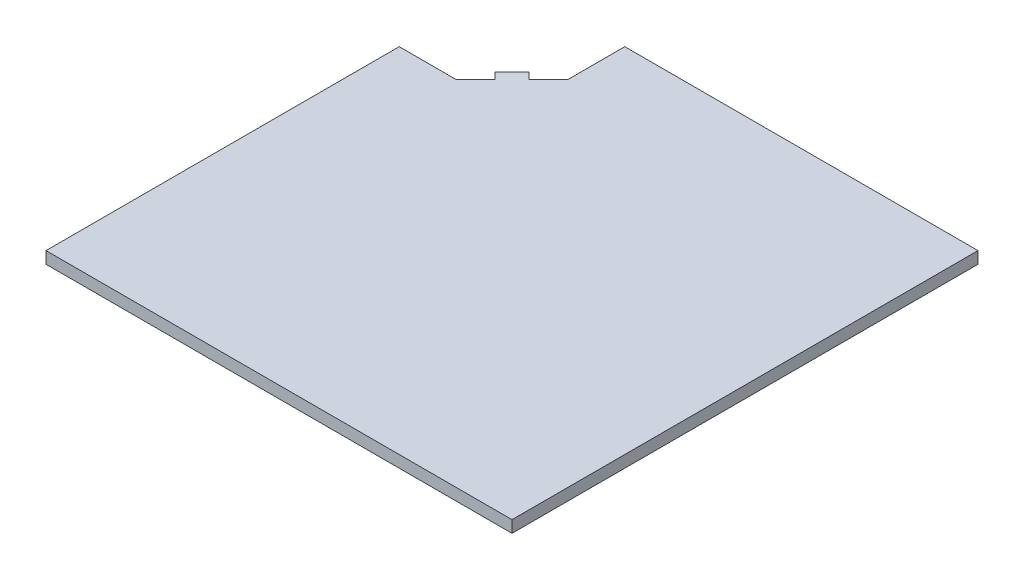
ISO-10303-21;
HEADER;
FILE_DESCRIPTION(('STEP AP214'),'2;1');
FILE_NAME('part.step','',(''),(''),'','','');
FILE_SCHEMA(('AUTOMOTIVE_DESIGN { 1 0 10303 214 1 1 1 1 }'));
ENDSEC;
DATA;
#1=APPLICATION_CONTEXT('core data for automotive mechanical design processes');
#2=APPLICATION_PROTOCOL_DEFINITION('international standard','automotive_design',2000,#1);
#3=PRODUCT_CONTEXT('',#1,'mechanical');
#4=PRODUCT('Part','Part','',(#3));
#5=PRODUCT_RELATED_PRODUCT_CATEGORY('part','',(#4));
#6=PRODUCT_DEFINITION_FORMATION('','',#4);
#7=PRODUCT_DEFINITION_CONTEXT('part definition',#1,'design');
#8=PRODUCT_DEFINITION('design','',#6,#7);
#9=PRODUCT_DEFINITION_SHAPE('','',#8);
#10=(LENGTH_UNIT() NAMED_UNIT(*) SI_UNIT(.MILLI.,.METRE.));
#11=(NAMED_UNIT(*) PLANE_ANGLE_UNIT() SI_UNIT($,.RADIAN.));
#12=(NAMED_UNIT(*) SI_UNIT($,.STERADIAN.) SOLID_ANGLE_UNIT());
#13=UNCERTAINTY_MEASURE_WITH_UNIT(LENGTH_MEASURE(1.E-05),#10,'distance_accuracy_value','');
#14=(GEOMETRIC_REPRESENTATION_CONTEXT(3) GLOBAL_UNCERTAINTY_ASSIGNED_CONTEXT((#13)) GLOBAL_UNIT_ASSIGNED_CONTEXT((#10,
#11,#12)) REPRESENTATION_CONTEXT('',''));
#15=CARTESIAN_POINT('',(0.,0.,0.));
#16=DIRECTION('',(0.,0.,1.));
#17=DIRECTION('',(1.,0.,0.));
#18=AXIS2_PLACEMENT_3D('',#15,#16,#17);
#19=CARTESIAN_POINT('',(3.925,0.2,3.925));
#20=DIRECTION('',(-1.,0.,0.));
#21=DIRECTION('',(0.,0.,1.));
#22=AXIS2_PLACEMENT_3D('',#19,#20,#21);
#23=PLANE('',#22);
#24=DIRECTION('',(0.,0.,-1.));
#25=VECTOR('',#24,1.);
#26=CARTESIAN_POINT('',(3.925,0.,3.925));
#27=LINE('',#26,#25);
#28=CARTESIAN_POINT('',(3.925,0.,3.925));
#29=VERTEX_POINT('',#28);
#30=CARTESIAN_POINT('',(3.925,0.,-3.925));
#31=VERTEX_POINT('',#30);
#32=EDGE_CURVE('E150',#29,#31,#27,.T.);
#33=ORIENTED_EDGE('',*,*,#32,.T.);
#34=DIRECTION('',(0.,-1.,0.));
#35=VECTOR('',#34,1.);
#36=CARTESIAN_POINT('',(3.925,0.2,-3.925));
#37=LINE('',#36,#35);
#38=CARTESIAN_POINT('',(3.925,0.2,-3.925));
#39=VERTEX_POINT('',#38);
#40=EDGE_CURVE('E11',#39,#31,#37,.T.);
#41=ORIENTED_EDGE('',*,*,#40,.F.);
#42=DIRECTION('',(0.,0.,-1.));
#43=VECTOR('',#42,1.);
#44=CARTESIAN_POINT('',(3.925,0.2,3.925));
#45=LINE('',#44,#43);
#46=CARTESIAN_POINT('',(3.925,0.2,3.925));
#47=VERTEX_POINT('',#46);
#48=EDGE_CURVE('E147',#47,#39,#45,.T.);
#49=ORIENTED_EDGE('',*,*,#48,.F.);
#50=DIRECTION('',(0.,-1.,0.));
#51=VECTOR('',#50,1.);
#52=CARTESIAN_POINT('',(3.925,0.2,3.925));
#53=LINE('',#52,#51);
#54=EDGE_CURVE('E154',#47,#29,#53,.T.);
#55=ORIENTED_EDGE('',*,*,#54,.T.);
#56=EDGE_LOOP('',(#33,#41,#49,#55));
#57=FACE_BOUND('',#56,.T.);
#58=ADVANCED_FACE('F32',(#57),#23,.F.);
#59=CARTESIAN_POINT('',(-3.925,0.2,-3.925));
#60=DIRECTION('',(0.,0.,1.));
#61=DIRECTION('',(1.,0.,0.));
#62=AXIS2_PLACEMENT_3D('',#59,#60,#61);
#63=PLANE('',#62);
#64=DIRECTION('',(-1.,0.,0.));
#65=VECTOR('',#64,1.);
#66=CARTESIAN_POINT('',(-3.925,0.,-3.925));
#67=LINE('',#66,#65);
#68=CARTESIAN_POINT('',(-2.025,0.,-3.925));
#69=VERTEX_POINT('',#68);
#70=EDGE_CURVE('E145',#31,#69,#67,.T.);
#71=ORIENTED_EDGE('',*,*,#70,.T.);
#72=DIRECTION('',(0.,1.,0.));
#73=VECTOR('',#72,1.);
#74=CARTESIAN_POINT('',(-2.025,0.,-3.925));
#75=LINE('',#74,#73);
#76=CARTESIAN_POINT('',(-2.025,0.2,-3.925));
#77=VERTEX_POINT('',#76);
#78=EDGE_CURVE('E161',#69,#77,#75,.T.);
#79=ORIENTED_EDGE('',*,*,#78,.T.);
#80=DIRECTION('',(-1.,0.,0.));
#81=VECTOR('',#80,1.);
#82=CARTESIAN_POINT('',(-3.925,0.2,-3.925));
#83=LINE('',#82,#81);
#84=EDGE_CURVE('E78',#39,#77,#83,.T.);
#85=ORIENTED_EDGE('',*,*,#84,.F.);
#86=ORIENTED_EDGE('',*,*,#40,.T.);
#87=EDGE_LOOP('',(#71,#79,#85,#86));
#88=FACE_BOUND('',#87,.T.);
#89=ADVANCED_FACE('F182',(#88),#63,.F.);
#90=CARTESIAN_POINT('',(-3.925,0.2,3.925));
#91=DIRECTION('',(1.,0.,0.));
#92=DIRECTION('',(0.,0.,-1.));
#93=AXIS2_PLACEMENT_3D('',#90,#91,#92);
#94=PLANE('',#93);
#95=DIRECTION('',(0.,0.,1.));
#96=VECTOR('',#95,1.);
#97=CARTESIAN_POINT('',(-3.925,0.2,3.925));
#98=LINE('',#97,#96);
#99=CARTESIAN_POINT('',(-3.925,0.2,-2.025));
#100=VERTEX_POINT('',#99);
#101=CARTESIAN_POINT('',(-3.925,0.2,3.925));
#102=VERTEX_POINT('',#101);
#103=EDGE_CURVE('E139',#100,#102,#98,.T.);
#104=ORIENTED_EDGE('',*,*,#103,.F.);
#105=DIRECTION('',(0.,1.,0.));
#106=VECTOR('',#105,1.);
#107=CARTESIAN_POINT('',(-3.925,0.,-2.025));
#108=LINE('',#107,#106);
#109=CARTESIAN_POINT('',(-3.925,0.,-2.025));
#110=VERTEX_POINT('',#109);
#111=EDGE_CURVE('E127',#110,#100,#108,.T.);
#112=ORIENTED_EDGE('',*,*,#111,.F.);
#113=DIRECTION('',(0.,0.,1.));
#114=VECTOR('',#113,1.);
#115=CARTESIAN_POINT('',(-3.925,0.,3.925));
#116=LINE('',#115,#114);
#117=CARTESIAN_POINT('',(-3.925,0.,3.925));
#118=VERTEX_POINT('',#117);
#119=EDGE_CURVE('E138',#110,#118,#116,.T.);
#120=ORIENTED_EDGE('',*,*,#119,.T.);
#121=DIRECTION('',(0.,-1.,0.));
#122=VECTOR('',#121,1.);
#123=CARTESIAN_POINT('',(-3.925,0.2,3.925));
#124=LINE('',#123,#122);
#125=EDGE_CURVE('E39',#102,#118,#124,.T.);
#126=ORIENTED_EDGE('',*,*,#125,.F.);
#127=EDGE_LOOP('',(#104,#112,#120,#126));
#128=FACE_BOUND('',#127,.T.);
#129=ADVANCED_FACE('F136',(#128),#94,.F.);
#130=CARTESIAN_POINT('',(-3.925,0.2,3.925));
#131=DIRECTION('',(0.,0.,-1.));
#132=DIRECTION('',(-1.,0.,0.));
#133=AXIS2_PLACEMENT_3D('',#130,#131,#132);
#134=PLANE('',#133);
#135=DIRECTION('',(1.,0.,0.));
#136=VECTOR('',#135,1.);
#137=CARTESIAN_POINT('',(-3.925,0.,3.925));
#138=LINE('',#137,#136);
#139=EDGE_CURVE('E72',#118,#29,#138,.T.);
#140=ORIENTED_EDGE('',*,*,#139,.T.);
#141=ORIENTED_EDGE('',*,*,#54,.F.);
#142=DIRECTION('',(1.,0.,0.));
#143=VECTOR('',#142,1.);
#144=CARTESIAN_POINT('',(-3.925,0.2,3.925));
#145=LINE('',#144,#143);
#146=EDGE_CURVE('E55',#102,#47,#145,.T.);
#147=ORIENTED_EDGE('',*,*,#146,.F.);
#148=ORIENTED_EDGE('',*,*,#125,.T.);
#149=EDGE_LOOP('',(#140,#141,#147,#148));
#150=FACE_BOUND('',#149,.T.);
#151=ADVANCED_FACE('F155',(#150),#134,.F.);
#152=CARTESIAN_POINT('',(0.,0.2,0.));
#153=DIRECTION('',(0.,-1.,0.));
#154=DIRECTION('',(0.,0.,-1.));
#155=AXIS2_PLACEMENT_3D('',#152,#153,#154);
#156=PLANE('',#155);
#157=ORIENTED_EDGE('',*,*,#84,.T.);
#158=DIRECTION('',(0.,0.,-1.));
#159=VECTOR('',#158,1.);
#160=CARTESIAN_POINT('',(-2.025,0.2,-2.97297933965094));
#161=LINE('',#160,#159);
#162=CARTESIAN_POINT('',(-2.025,0.2,-2.97297933965094));
#163=VERTEX_POINT('',#162);
#164=EDGE_CURVE('E132',#163,#77,#161,.T.);
#165=ORIENTED_EDGE('',*,*,#164,.F.);
#166=DIRECTION('',(0.707106781186547,0.,-0.707106781186547));
#167=VECTOR('',#166,1.);
#168=CARTESIAN_POINT('',(-2.35756831358816,0.2,-2.64041102606278));
#169=LINE('',#168,#167);
#170=CARTESIAN_POINT('',(-2.35756831358816,0.2,-2.64041102606278));
#171=VERTEX_POINT('',#170);
#172=EDGE_CURVE('E207',#171,#163,#169,.T.);
#173=ORIENTED_EDGE('',*,*,#172,.F.);
#174=DIRECTION('',(0.707106781186548,0.,0.707106781186548));
#175=VECTOR('',#174,1.);
#176=CARTESIAN_POINT('',(-2.46363433076614,0.2,-2.74647704324076));
#177=LINE('',#176,#175);
#178=CARTESIAN_POINT('',(-2.46363433076614,0.2,-2.74647704324076));
#179=VERTEX_POINT('',#178);
#180=EDGE_CURVE('E205',#179,#171,#177,.T.);
#181=ORIENTED_EDGE('',*,*,#180,.F.);
#182=DIRECTION('',(0.707106781186547,0.,-0.707106781186547));
#183=VECTOR('',#182,1.);
#184=CARTESIAN_POINT('',(-2.74647704324076,0.2,-2.46363433076615));
#185=LINE('',#184,#183);
#186=CARTESIAN_POINT('',(-2.74647704324076,0.2,-2.46363433076615));
#187=VERTEX_POINT('',#186);
#188=EDGE_CURVE('E202',#187,#179,#185,.T.);
#189=ORIENTED_EDGE('',*,*,#188,.F.);
#190=DIRECTION('',(-0.707106781186548,0.,-0.707106781186548));
#191=VECTOR('',#190,1.);
#192=CARTESIAN_POINT('',(-2.64041102606278,0.2,-2.35756831358816));
#193=LINE('',#192,#191);
#194=CARTESIAN_POINT('',(-2.64041102606278,0.2,-2.35756831358816));
#195=VERTEX_POINT('',#194);
#196=EDGE_CURVE('E199',#195,#187,#193,.T.);
#197=ORIENTED_EDGE('',*,*,#196,.F.);
#198=DIRECTION('',(0.707106781186547,0.,-0.707106781186547));
#199=VECTOR('',#198,1.);
#200=CARTESIAN_POINT('',(-2.97297933965094,0.2,-2.025));
#201=LINE('',#200,#199);
#202=CARTESIAN_POINT('',(-2.97297933965094,0.2,-2.025));
#203=VERTEX_POINT('',#202);
#204=EDGE_CURVE('E196',#203,#195,#201,.T.);
#205=ORIENTED_EDGE('',*,*,#204,.F.);
#206=DIRECTION('',(1.,0.,0.));
#207=VECTOR('',#206,1.);
#208=CARTESIAN_POINT('',(-3.925,0.2,-2.025));
#209=LINE('',#208,#207);
#210=EDGE_CURVE('E194',#100,#203,#209,.T.);
#211=ORIENTED_EDGE('',*,*,#210,.F.);
#212=ORIENTED_EDGE('',*,*,#103,.T.);
#213=ORIENTED_EDGE('',*,*,#146,.T.);
#214=ORIENTED_EDGE('',*,*,#48,.T.);
#215=EDGE_LOOP('',(#157,#165,#173,#181,#189,#197,#205,#211,#212,#213,#214));
#216=FACE_BOUND('',#215,.T.);
#217=ADVANCED_FACE('F180',(#216),#156,.F.);
#218=CARTESIAN_POINT('',(0.,0.,0.));
#219=DIRECTION('',(0.,-1.,0.));
#220=DIRECTION('',(0.,0.,-1.));
#221=AXIS2_PLACEMENT_3D('',#218,#219,#220);
#222=PLANE('',#221);
#223=DIRECTION('',(0.,0.,-1.));
#224=VECTOR('',#223,1.);
#225=CARTESIAN_POINT('',(-2.025,0.,-2.97297933965094));
#226=LINE('',#225,#224);
#227=CARTESIAN_POINT('',(-2.025,0.,-2.97297933965094));
#228=VERTEX_POINT('',#227);
#229=EDGE_CURVE('E140',#228,#69,#226,.T.);
#230=ORIENTED_EDGE('',*,*,#229,.T.);
#231=ORIENTED_EDGE('',*,*,#70,.F.);
#232=ORIENTED_EDGE('',*,*,#32,.F.);
#233=ORIENTED_EDGE('',*,*,#139,.F.);
#234=ORIENTED_EDGE('',*,*,#119,.F.);
#235=DIRECTION('',(1.,0.,0.));
#236=VECTOR('',#235,1.);
#237=CARTESIAN_POINT('',(-3.925,0.,-2.025));
#238=LINE('',#237,#236);
#239=CARTESIAN_POINT('',(-2.97297933965094,0.,-2.025));
#240=VERTEX_POINT('',#239);
#241=EDGE_CURVE('E123',#110,#240,#238,.T.);
#242=ORIENTED_EDGE('',*,*,#241,.T.);
#243=DIRECTION('',(0.707106781186547,0.,-0.707106781186547));
#244=VECTOR('',#243,1.);
#245=CARTESIAN_POINT('',(-2.97297933965094,0.,-2.025));
#246=LINE('',#245,#244);
#247=CARTESIAN_POINT('',(-2.64041102606278,0.,-2.35756831358816));
#248=VERTEX_POINT('',#247);
#249=EDGE_CURVE('E46',#240,#248,#246,.T.);
#250=ORIENTED_EDGE('',*,*,#249,.T.);
#251=DIRECTION('',(-0.707106781186548,0.,-0.707106781186548));
#252=VECTOR('',#251,1.);
#253=CARTESIAN_POINT('',(-2.64041102606278,0.,-2.35756831358816));
#254=LINE('',#253,#252);
#255=CARTESIAN_POINT('',(-2.74647704324076,0.,-2.46363433076615));
#256=VERTEX_POINT('',#255);
#257=EDGE_CURVE('E218',#248,#256,#254,.T.);
#258=ORIENTED_EDGE('',*,*,#257,.T.);
#259=DIRECTION('',(0.707106781186547,0.,-0.707106781186547));
#260=VECTOR('',#259,1.);
#261=CARTESIAN_POINT('',(-2.74647704324076,0.,-2.46363433076615));
#262=LINE('',#261,#260);
#263=CARTESIAN_POINT('',(-2.46363433076614,0.,-2.74647704324076));
#264=VERTEX_POINT('',#263);
#265=EDGE_CURVE('E216',#256,#264,#262,.T.);
#266=ORIENTED_EDGE('',*,*,#265,.T.);
#267=DIRECTION('',(0.707106781186548,0.,0.707106781186548));
#268=VECTOR('',#267,1.);
#269=CARTESIAN_POINT('',(-2.46363433076614,0.,-2.74647704324076));
#270=LINE('',#269,#268);
#271=CARTESIAN_POINT('',(-2.35756831358816,0.,-2.64041102606278));
#272=VERTEX_POINT('',#271);
#273=EDGE_CURVE('E190',#264,#272,#270,.T.);
#274=ORIENTED_EDGE('',*,*,#273,.T.);
#275=DIRECTION('',(0.707106781186547,0.,-0.707106781186547));
#276=VECTOR('',#275,1.);
#277=CARTESIAN_POINT('',(-2.35756831358816,0.,-2.64041102606278));
#278=LINE('',#277,#276);
#279=EDGE_CURVE('E187',#272,#228,#278,.T.);
#280=ORIENTED_EDGE('',*,*,#279,.T.);
#281=EDGE_LOOP('',(#230,#231,#232,#233,#234,#242,#250,#258,#266,#274,#280));
#282=FACE_BOUND('',#281,.T.);
#283=ADVANCED_FACE('F143',(#282),#222,.T.);
#284=CARTESIAN_POINT('',(-2.025,0.,-2.97297933965094));
#285=DIRECTION('',(1.,0.,0.));
#286=DIRECTION('',(0.,0.,-1.));
#287=AXIS2_PLACEMENT_3D('',#284,#285,#286);
#288=PLANE('',#287);
#289=ORIENTED_EDGE('',*,*,#164,.T.);
#290=ORIENTED_EDGE('',*,*,#78,.F.);
#291=ORIENTED_EDGE('',*,*,#229,.F.);
#292=DIRECTION('',(0.,1.,0.));
#293=VECTOR('',#292,1.);
#294=CARTESIAN_POINT('',(-2.025,0.,-2.97297933965094));
#295=LINE('',#294,#293);
#296=EDGE_CURVE('E164',#228,#163,#295,.T.);
#297=ORIENTED_EDGE('',*,*,#296,.T.);
#298=EDGE_LOOP('',(#289,#290,#291,#297));
#299=FACE_BOUND('',#298,.T.);
#300=ADVANCED_FACE('F210',(#299),#288,.F.);
#301=CARTESIAN_POINT('',(-2.35756831358816,0.,-2.64041102606278));
#302=DIRECTION('',(0.707106781186548,0.,0.707106781186548));
#303=DIRECTION('',(0.707106781186548,0.,-0.707106781186548));
#304=AXIS2_PLACEMENT_3D('',#301,#302,#303);
#305=PLANE('',#304);
#306=ORIENTED_EDGE('',*,*,#172,.T.);
#307=ORIENTED_EDGE('',*,*,#296,.F.);
#308=ORIENTED_EDGE('',*,*,#279,.F.);
#309=DIRECTION('',(0.,1.,0.));
#310=VECTOR('',#309,1.);
#311=CARTESIAN_POINT('',(-2.35756831358816,0.,-2.64041102606278));
#312=LINE('',#311,#310);
#313=EDGE_CURVE('E166',#272,#171,#312,.T.);
#314=ORIENTED_EDGE('',*,*,#313,.T.);
#315=EDGE_LOOP('',(#306,#307,#308,#314));
#316=FACE_BOUND('',#315,.T.);
#317=ADVANCED_FACE('F211',(#316),#305,.F.);
#318=CARTESIAN_POINT('',(-2.46363433076614,0.,-2.74647704324076));
#319=DIRECTION('',(-0.707106781186548,0.,0.707106781186548));
#320=DIRECTION('',(0.707106781186548,0.,0.707106781186548));
#321=AXIS2_PLACEMENT_3D('',#318,#319,#320);
#322=PLANE('',#321);
#323=ORIENTED_EDGE('',*,*,#180,.T.);
#324=ORIENTED_EDGE('',*,*,#313,.F.);
#325=ORIENTED_EDGE('',*,*,#273,.F.);
#326=DIRECTION('',(0.,1.,0.));
#327=VECTOR('',#326,1.);
#328=CARTESIAN_POINT('',(-2.46363433076614,0.,-2.74647704324076));
#329=LINE('',#328,#327);
#330=EDGE_CURVE('E172',#264,#179,#329,.T.);
#331=ORIENTED_EDGE('',*,*,#330,.T.);
#332=EDGE_LOOP('',(#323,#324,#325,#331));
#333=FACE_BOUND('',#332,.T.);
#334=ADVANCED_FACE('F230',(#333),#322,.F.);
#335=CARTESIAN_POINT('',(-2.74647704324076,0.,-2.46363433076615));
#336=DIRECTION('',(0.707106781186547,0.,0.707106781186547));
#337=DIRECTION('',(0.707106781186547,0.,-0.707106781186547));
#338=AXIS2_PLACEMENT_3D('',#335,#336,#337);
#339=PLANE('',#338);
#340=ORIENTED_EDGE('',*,*,#188,.T.);
#341=ORIENTED_EDGE('',*,*,#330,.F.);
#342=ORIENTED_EDGE('',*,*,#265,.F.);
#343=DIRECTION('',(0.,1.,0.));
#344=VECTOR('',#343,1.);
#345=CARTESIAN_POINT('',(-2.74647704324076,0.,-2.46363433076615));
#346=LINE('',#345,#344);
#347=EDGE_CURVE('E174',#256,#187,#346,.T.);
#348=ORIENTED_EDGE('',*,*,#347,.T.);
#349=EDGE_LOOP('',(#340,#341,#342,#348));
#350=FACE_BOUND('',#349,.T.);
#351=ADVANCED_FACE('F228',(#350),#339,.F.);
#352=CARTESIAN_POINT('',(-2.64041102606278,0.,-2.35756831358816));
#353=DIRECTION('',(0.707106781186548,0.,-0.707106781186548));
#354=DIRECTION('',(-0.707106781186548,0.,-0.707106781186548));
#355=AXIS2_PLACEMENT_3D('',#352,#353,#354);
#356=PLANE('',#355);
#357=ORIENTED_EDGE('',*,*,#196,.T.);
#358=ORIENTED_EDGE('',*,*,#347,.F.);
#359=ORIENTED_EDGE('',*,*,#257,.F.);
#360=DIRECTION('',(0.,1.,0.));
#361=VECTOR('',#360,1.);
#362=CARTESIAN_POINT('',(-2.64041102606278,0.,-2.35756831358816));
#363=LINE('',#362,#361);
#364=EDGE_CURVE('E176',#248,#195,#363,.T.);
#365=ORIENTED_EDGE('',*,*,#364,.T.);
#366=EDGE_LOOP('',(#357,#358,#359,#365));
#367=FACE_BOUND('',#366,.T.);
#368=ADVANCED_FACE('F224',(#367),#356,.F.);
#369=CARTESIAN_POINT('',(-2.97297933965094,0.,-2.025));
#370=DIRECTION('',(0.707106781186548,0.,0.707106781186548));
#371=DIRECTION('',(0.707106781186548,0.,-0.707106781186548));
#372=AXIS2_PLACEMENT_3D('',#369,#370,#371);
#373=PLANE('',#372);
#374=ORIENTED_EDGE('',*,*,#204,.T.);
#375=ORIENTED_EDGE('',*,*,#364,.F.);
#376=ORIENTED_EDGE('',*,*,#249,.F.);
#377=DIRECTION('',(0.,1.,0.));
#378=VECTOR('',#377,1.);
#379=CARTESIAN_POINT('',(-2.97297933965094,0.,-2.025));
#380=LINE('',#379,#378);
#381=EDGE_CURVE('E129',#240,#203,#380,.T.);
#382=ORIENTED_EDGE('',*,*,#381,.T.);
#383=EDGE_LOOP('',(#374,#375,#376,#382));
#384=FACE_BOUND('',#383,.T.);
#385=ADVANCED_FACE('F232',(#384),#373,.F.);
#386=CARTESIAN_POINT('',(-3.925,0.,-2.025));
#387=DIRECTION('',(0.,0.,1.));
#388=DIRECTION('',(1.,0.,0.));
#389=AXIS2_PLACEMENT_3D('',#386,#387,#388);
#390=PLANE('',#389);
#391=ORIENTED_EDGE('',*,*,#210,.T.);
#392=ORIENTED_EDGE('',*,*,#381,.F.);
#393=ORIENTED_EDGE('',*,*,#241,.F.);
#394=ORIENTED_EDGE('',*,*,#111,.T.);
#395=EDGE_LOOP('',(#391,#392,#393,#394));
#396=FACE_BOUND('',#395,.T.);
#397=ADVANCED_FACE('F126',(#396),#390,.F.);
#398=CLOSED_SHELL('',(#58,#89,#129,#151,#217,#283,#300,#317,#334,#351,#368,#385,#397));
#399=MANIFOLD_SOLID_BREP('B2',#398);
#400=ADVANCED_BREP_SHAPE_REPRESENTATION('',(#18,#399),#14);
#401=SHAPE_DEFINITION_REPRESENTATION(#9,#400);
ENDSEC;
END-ISO-10303-21;
